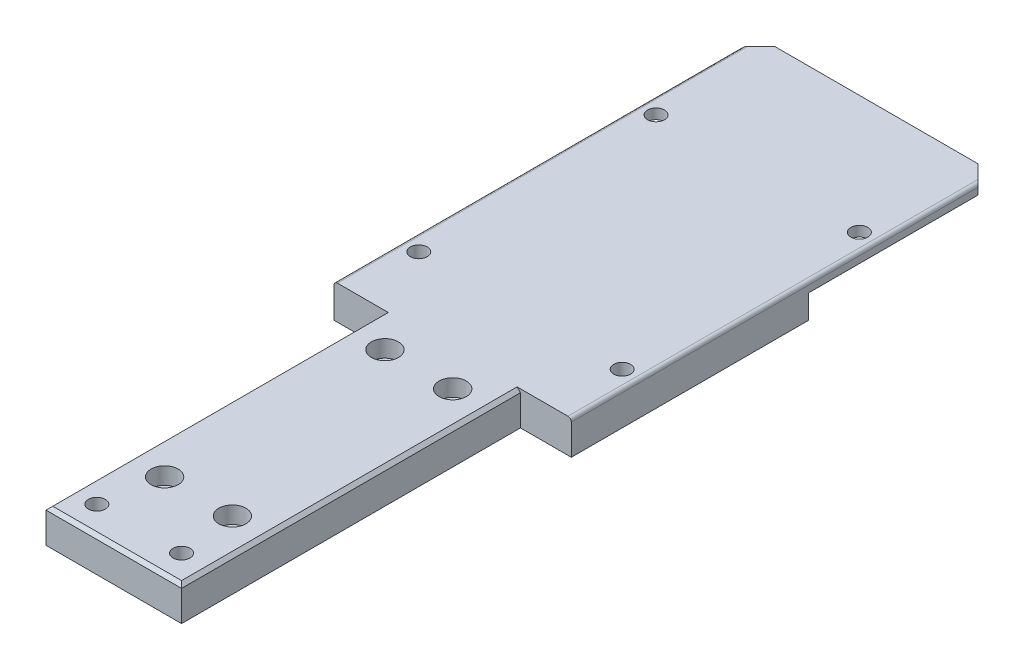
ISO-10303-21;
HEADER;
FILE_DESCRIPTION(('STEP AP214'),'2;1');
FILE_NAME('part.step','',(''),(''),'','','');
FILE_SCHEMA(('AUTOMOTIVE_DESIGN { 1 0 10303 214 1 1 1 1 }'));
ENDSEC;
DATA;
#1=APPLICATION_CONTEXT('core data for automotive mechanical design processes');
#2=APPLICATION_PROTOCOL_DEFINITION('international standard','automotive_design',2000,#1);
#3=PRODUCT_CONTEXT('',#1,'mechanical');
#4=PRODUCT('Part','Part','',(#3));
#5=PRODUCT_RELATED_PRODUCT_CATEGORY('part','',(#4));
#6=PRODUCT_DEFINITION_FORMATION('','',#4);
#7=PRODUCT_DEFINITION_CONTEXT('part definition',#1,'design');
#8=PRODUCT_DEFINITION('design','',#6,#7);
#9=PRODUCT_DEFINITION_SHAPE('','',#8);
#10=(LENGTH_UNIT() NAMED_UNIT(*) SI_UNIT(.MILLI.,.METRE.));
#11=(NAMED_UNIT(*) PLANE_ANGLE_UNIT() SI_UNIT($,.RADIAN.));
#12=(NAMED_UNIT(*) SI_UNIT($,.STERADIAN.) SOLID_ANGLE_UNIT());
#13=UNCERTAINTY_MEASURE_WITH_UNIT(LENGTH_MEASURE(1.E-05),#10,'distance_accuracy_value','');
#14=(GEOMETRIC_REPRESENTATION_CONTEXT(3) GLOBAL_UNCERTAINTY_ASSIGNED_CONTEXT((#13)) GLOBAL_UNIT_ASSIGNED_CONTEXT((#10,
#11,#12)) REPRESENTATION_CONTEXT('',''));
#15=CARTESIAN_POINT('',(0.,0.,0.));
#16=DIRECTION('',(0.,0.,1.));
#17=DIRECTION('',(1.,0.,0.));
#18=AXIS2_PLACEMENT_3D('',#15,#16,#17);
#19=CARTESIAN_POINT('',(55.,10.,-220.));
#20=DIRECTION('',(-0.707106781186549,0.,0.707106781186546));
#21=DIRECTION('',(0.707106781186546,0.,0.707106781186549));
#22=AXIS2_PLACEMENT_3D('',#19,#20,#21);
#23=PLANE('',#22);
#24=DIRECTION('',(-0.707106781186546,0.,-0.707106781186549));
#25=VECTOR('',#24,1.);
#26=CARTESIAN_POINT('',(55.,10.,-220.));
#27=LINE('',#26,#25);
#28=CARTESIAN_POINT('',(54.,10.,-221.));
#29=VERTEX_POINT('',#28);
#30=CARTESIAN_POINT('',(50.,10.,-225.));
#31=VERTEX_POINT('',#30);
#32=EDGE_CURVE('E193',#29,#31,#27,.T.);
#33=ORIENTED_EDGE('',*,*,#32,.F.);
#34=CARTESIAN_POINT('',(54.,9.,-221.));
#35=DIRECTION('',(-0.707106781186549,0.,0.707106781186546));
#36=DIRECTION('',(0.707106781186546,0.,0.707106781186549));
#37=AXIS2_PLACEMENT_3D('',#34,#35,#36);
#38=ELLIPSE('',#37,1.4142135623731,1.);
#39=CARTESIAN_POINT('',(55.,9.,-220.));
#40=VERTEX_POINT('',#39);
#41=EDGE_CURVE('E278',#29,#40,#38,.F.);
#42=ORIENTED_EDGE('',*,*,#41,.T.);
#43=DIRECTION('',(0.,-1.,0.));
#44=VECTOR('',#43,1.);
#45=CARTESIAN_POINT('',(55.,10.,-220.));
#46=LINE('',#45,#44);
#47=CARTESIAN_POINT('',(55.,7.,-220.));
#48=VERTEX_POINT('',#47);
#49=EDGE_CURVE('E229',#40,#48,#46,.T.);
#50=ORIENTED_EDGE('',*,*,#49,.T.);
#51=DIRECTION('',(0.707106781186546,0.,0.707106781186549));
#52=VECTOR('',#51,1.);
#53=CARTESIAN_POINT('',(50.,7.,-225.));
#54=LINE('',#53,#52);
#55=CARTESIAN_POINT('',(50.,7.,-225.));
#56=VERTEX_POINT('',#55);
#57=EDGE_CURVE('E174',#56,#48,#54,.T.);
#58=ORIENTED_EDGE('',*,*,#57,.F.);
#59=DIRECTION('',(0.,-1.,0.));
#60=VECTOR('',#59,1.);
#61=CARTESIAN_POINT('',(50.,10.,-225.));
#62=LINE('',#61,#60);
#63=EDGE_CURVE('E226',#31,#56,#62,.T.);
#64=ORIENTED_EDGE('',*,*,#63,.F.);
#65=EDGE_LOOP('',(#33,#42,#50,#58,#64));
#66=FACE_BOUND('',#65,.T.);
#67=ADVANCED_FACE('F39',(#66),#23,.F.);
#68=CARTESIAN_POINT('',(50.,10.,-225.));
#69=DIRECTION('',(0.,0.,1.));
#70=DIRECTION('',(1.,0.,0.));
#71=AXIS2_PLACEMENT_3D('',#68,#69,#70);
#72=PLANE('',#71);
#73=DIRECTION('',(1.,0.,0.));
#74=VECTOR('',#73,1.);
#75=CARTESIAN_POINT('',(-9.99999999999998,7.,-225.));
#76=LINE('',#75,#74);
#77=CARTESIAN_POINT('',(-9.99999999999998,7.,-225.));
#78=VERTEX_POINT('',#77);
#79=EDGE_CURVE('E172',#78,#56,#76,.T.);
#80=ORIENTED_EDGE('',*,*,#79,.F.);
#81=DIRECTION('',(0.,-1.,0.));
#82=VECTOR('',#81,1.);
#83=CARTESIAN_POINT('',(-9.99999999999998,10.,-225.));
#84=LINE('',#83,#82);
#85=CARTESIAN_POINT('',(-9.99999999999998,10.,-225.));
#86=VERTEX_POINT('',#85);
#87=EDGE_CURVE('E156',#86,#78,#84,.T.);
#88=ORIENTED_EDGE('',*,*,#87,.F.);
#89=DIRECTION('',(-1.,0.,0.));
#90=VECTOR('',#89,1.);
#91=CARTESIAN_POINT('',(50.,10.,-225.));
#92=LINE('',#91,#90);
#93=EDGE_CURVE('E196',#31,#86,#92,.T.);
#94=ORIENTED_EDGE('',*,*,#93,.F.);
#95=ORIENTED_EDGE('',*,*,#63,.T.);
#96=EDGE_LOOP('',(#80,#88,#94,#95));
#97=FACE_BOUND('',#96,.T.);
#98=ADVANCED_FACE('F323',(#97),#72,.F.);
#99=CARTESIAN_POINT('',(-9.99999999999998,10.,-225.));
#100=DIRECTION('',(0.707106781186546,0.,0.707106781186549));
#101=DIRECTION('',(0.707106781186549,0.,-0.707106781186546));
#102=AXIS2_PLACEMENT_3D('',#99,#100,#101);
#103=PLANE('',#102);
#104=DIRECTION('',(0.,-1.,0.));
#105=VECTOR('',#104,1.);
#106=CARTESIAN_POINT('',(-15.,10.,-220.));
#107=LINE('',#106,#105);
#108=CARTESIAN_POINT('',(-15.,9.,-220.));
#109=VERTEX_POINT('',#108);
#110=CARTESIAN_POINT('',(-15.,7.,-220.));
#111=VERTEX_POINT('',#110);
#112=EDGE_CURVE('E148',#109,#111,#107,.T.);
#113=ORIENTED_EDGE('',*,*,#112,.F.);
#114=CARTESIAN_POINT('',(-14.,9.,-221.));
#115=DIRECTION('',(0.707106781186546,0.,0.707106781186549));
#116=DIRECTION('',(0.707106781186549,0.,-0.707106781186546));
#117=AXIS2_PLACEMENT_3D('',#114,#115,#116);
#118=ELLIPSE('',#117,1.41421356237309,1.);
#119=CARTESIAN_POINT('',(-14.,10.,-221.));
#120=VERTEX_POINT('',#119);
#121=EDGE_CURVE('E11',#109,#120,#118,.F.);
#122=ORIENTED_EDGE('',*,*,#121,.T.);
#123=DIRECTION('',(-0.707106781186549,0.,0.707106781186545));
#124=VECTOR('',#123,1.);
#125=CARTESIAN_POINT('',(-9.99999999999998,10.,-225.));
#126=LINE('',#125,#124);
#127=EDGE_CURVE('E198',#86,#120,#126,.T.);
#128=ORIENTED_EDGE('',*,*,#127,.F.);
#129=ORIENTED_EDGE('',*,*,#87,.T.);
#130=DIRECTION('',(0.707106781186549,0.,-0.707106781186545));
#131=VECTOR('',#130,1.);
#132=CARTESIAN_POINT('',(-15.,7.,-220.));
#133=LINE('',#132,#131);
#134=EDGE_CURVE('E162',#111,#78,#133,.T.);
#135=ORIENTED_EDGE('',*,*,#134,.F.);
#136=EDGE_LOOP('',(#113,#122,#128,#129,#135));
#137=FACE_BOUND('',#136,.T.);
#138=ADVANCED_FACE('F169',(#137),#103,.F.);
#139=CARTESIAN_POINT('',(0.,10.,-100.));
#140=DIRECTION('',(1.,0.,0.));
#141=DIRECTION('',(0.,0.,-1.));
#142=AXIS2_PLACEMENT_3D('',#139,#140,#141);
#143=PLANE('',#142);
#144=DIRECTION('',(0.,-1.,0.));
#145=VECTOR('',#144,1.);
#146=CARTESIAN_POINT('',(0.,10.,0.));
#147=LINE('',#146,#145);
#148=CARTESIAN_POINT('',(0.,9.,0.));
#149=VERTEX_POINT('',#148);
#150=CARTESIAN_POINT('',(0.,0.,0.));
#151=VERTEX_POINT('',#150);
#152=EDGE_CURVE('E237',#149,#151,#147,.T.);
#153=ORIENTED_EDGE('',*,*,#152,.F.);
#154=DIRECTION('',(0.,0.,-1.));
#155=VECTOR('',#154,1.);
#156=CARTESIAN_POINT('',(0.,9.,-100.));
#157=LINE('',#156,#155);
#158=CARTESIAN_POINT('',(0.,9.,-100.));
#159=VERTEX_POINT('',#158);
#160=EDGE_CURVE('E255',#149,#159,#157,.T.);
#161=ORIENTED_EDGE('',*,*,#160,.T.);
#162=DIRECTION('',(0.,-1.,0.));
#163=VECTOR('',#162,1.);
#164=CARTESIAN_POINT('',(0.,10.,-100.));
#165=LINE('',#164,#163);
#166=CARTESIAN_POINT('',(0.,0.,-100.));
#167=VERTEX_POINT('',#166);
#168=EDGE_CURVE('E203',#159,#167,#165,.T.);
#169=ORIENTED_EDGE('',*,*,#168,.T.);
#170=DIRECTION('',(0.,0.,1.));
#171=VECTOR('',#170,1.);
#172=CARTESIAN_POINT('',(0.,0.,-100.));
#173=LINE('',#172,#171);
#174=EDGE_CURVE('E188',#167,#151,#173,.T.);
#175=ORIENTED_EDGE('',*,*,#174,.T.);
#176=EDGE_LOOP('',(#153,#161,#169,#175));
#177=FACE_BOUND('',#176,.T.);
#178=ADVANCED_FACE('F331',(#177),#143,.F.);
#179=CARTESIAN_POINT('',(0.,10.,0.));
#180=DIRECTION('',(0.,0.,-1.));
#181=DIRECTION('',(-1.,0.,0.));
#182=AXIS2_PLACEMENT_3D('',#179,#180,#181);
#183=PLANE('',#182);
#184=DIRECTION('',(0.,-1.,0.));
#185=VECTOR('',#184,1.);
#186=CARTESIAN_POINT('',(40.,10.,0.));
#187=LINE('',#186,#185);
#188=CARTESIAN_POINT('',(40.,9.,0.));
#189=VERTEX_POINT('',#188);
#190=CARTESIAN_POINT('',(40.,0.,0.));
#191=VERTEX_POINT('',#190);
#192=EDGE_CURVE('E235',#189,#191,#187,.T.);
#193=ORIENTED_EDGE('',*,*,#192,.F.);
#194=DIRECTION('',(-1.,0.,0.));
#195=VECTOR('',#194,1.);
#196=CARTESIAN_POINT('',(0.,9.,0.));
#197=LINE('',#196,#195);
#198=EDGE_CURVE('E259',#189,#149,#197,.T.);
#199=ORIENTED_EDGE('',*,*,#198,.T.);
#200=ORIENTED_EDGE('',*,*,#152,.T.);
#201=DIRECTION('',(1.,0.,0.));
#202=VECTOR('',#201,1.);
#203=CARTESIAN_POINT('',(0.,0.,0.));
#204=LINE('',#203,#202);
#205=EDGE_CURVE('E206',#151,#191,#204,.T.);
#206=ORIENTED_EDGE('',*,*,#205,.T.);
#207=EDGE_LOOP('',(#193,#199,#200,#206));
#208=FACE_BOUND('',#207,.T.);
#209=ADVANCED_FACE('F344',(#208),#183,.F.);
#210=CARTESIAN_POINT('',(40.,10.,0.));
#211=DIRECTION('',(-1.,0.,0.));
#212=DIRECTION('',(0.,0.,1.));
#213=AXIS2_PLACEMENT_3D('',#210,#211,#212);
#214=PLANE('',#213);
#215=DIRECTION('',(0.,-1.,0.));
#216=VECTOR('',#215,1.);
#217=CARTESIAN_POINT('',(40.,10.,-100.));
#218=LINE('',#217,#216);
#219=CARTESIAN_POINT('',(40.,9.,-100.));
#220=VERTEX_POINT('',#219);
#221=CARTESIAN_POINT('',(40.,0.,-100.));
#222=VERTEX_POINT('',#221);
#223=EDGE_CURVE('E233',#220,#222,#218,.T.);
#224=ORIENTED_EDGE('',*,*,#223,.F.);
#225=DIRECTION('',(0.,0.,1.));
#226=VECTOR('',#225,1.);
#227=CARTESIAN_POINT('',(40.,9.,0.));
#228=LINE('',#227,#226);
#229=EDGE_CURVE('E257',#220,#189,#228,.T.);
#230=ORIENTED_EDGE('',*,*,#229,.T.);
#231=ORIENTED_EDGE('',*,*,#192,.T.);
#232=DIRECTION('',(0.,0.,-1.));
#233=VECTOR('',#232,1.);
#234=CARTESIAN_POINT('',(40.,0.,0.));
#235=LINE('',#234,#233);
#236=EDGE_CURVE('E209',#191,#222,#235,.T.);
#237=ORIENTED_EDGE('',*,*,#236,.T.);
#238=EDGE_LOOP('',(#224,#230,#231,#237));
#239=FACE_BOUND('',#238,.T.);
#240=ADVANCED_FACE('F341',(#239),#214,.F.);
#241=CARTESIAN_POINT('',(40.,10.,-100.));
#242=DIRECTION('',(0.,0.,-1.));
#243=DIRECTION('',(-1.,0.,0.));
#244=AXIS2_PLACEMENT_3D('',#241,#242,#243);
#245=PLANE('',#244);
#246=DIRECTION('',(0.,-1.,0.));
#247=VECTOR('',#246,1.);
#248=CARTESIAN_POINT('',(55.,10.,-100.));
#249=LINE('',#248,#247);
#250=CARTESIAN_POINT('',(55.,9.,-100.));
#251=VERTEX_POINT('',#250);
#252=CARTESIAN_POINT('',(55.,0.,-100.));
#253=VERTEX_POINT('',#252);
#254=EDGE_CURVE('E231',#251,#253,#249,.T.);
#255=ORIENTED_EDGE('',*,*,#254,.F.);
#256=CARTESIAN_POINT('',(54.,9.,-100.));
#257=DIRECTION('',(0.,0.,-1.));
#258=DIRECTION('',(-1.,0.,0.));
#259=AXIS2_PLACEMENT_3D('',#256,#257,#258);
#260=CIRCLE('',#259,1.);
#261=CARTESIAN_POINT('',(54.,10.,-100.));
#262=VERTEX_POINT('',#261);
#263=EDGE_CURVE('E282',#251,#262,#260,.F.);
#264=ORIENTED_EDGE('',*,*,#263,.T.);
#265=DIRECTION('',(1.,0.,0.));
#266=VECTOR('',#265,1.);
#267=CARTESIAN_POINT('',(40.,10.,-100.));
#268=LINE('',#267,#266);
#269=CARTESIAN_POINT('',(39.,10.,-100.));
#270=VERTEX_POINT('',#269);
#271=EDGE_CURVE('E190',#270,#262,#268,.T.);
#272=ORIENTED_EDGE('',*,*,#271,.F.);
#273=DIRECTION('',(0.707106781186538,-0.707106781186557,0.));
#274=VECTOR('',#273,1.);
#275=CARTESIAN_POINT('',(39.5,9.50000000000001,-100.));
#276=LINE('',#275,#274);
#277=EDGE_CURVE('E264',#270,#220,#276,.T.);
#278=ORIENTED_EDGE('',*,*,#277,.T.);
#279=ORIENTED_EDGE('',*,*,#223,.T.);
#280=DIRECTION('',(1.,0.,0.));
#281=VECTOR('',#280,1.);
#282=CARTESIAN_POINT('',(40.,0.,-100.));
#283=LINE('',#282,#281);
#284=EDGE_CURVE('E212',#222,#253,#283,.T.);
#285=ORIENTED_EDGE('',*,*,#284,.T.);
#286=EDGE_LOOP('',(#255,#264,#272,#278,#279,#285));
#287=FACE_BOUND('',#286,.T.);
#288=ADVANCED_FACE('F287',(#287),#245,.F.);
#289=CARTESIAN_POINT('',(55.,10.,-100.));
#290=DIRECTION('',(-1.,0.,0.));
#291=DIRECTION('',(0.,0.,1.));
#292=AXIS2_PLACEMENT_3D('',#289,#290,#291);
#293=PLANE('',#292);
#294=ORIENTED_EDGE('',*,*,#49,.F.);
#295=DIRECTION('',(0.,0.,-1.));
#296=VECTOR('',#295,1.);
#297=CARTESIAN_POINT('',(55.,9.,-100.));
#298=LINE('',#297,#296);
#299=EDGE_CURVE('E280',#40,#251,#298,.F.);
#300=ORIENTED_EDGE('',*,*,#299,.T.);
#301=ORIENTED_EDGE('',*,*,#254,.T.);
#302=DIRECTION('',(0.,0.,-1.));
#303=VECTOR('',#302,1.);
#304=CARTESIAN_POINT('',(55.,0.,-100.));
#305=LINE('',#304,#303);
#306=CARTESIAN_POINT('',(55.,0.,-170.));
#307=VERTEX_POINT('',#306);
#308=EDGE_CURVE('E215',#253,#307,#305,.T.);
#309=ORIENTED_EDGE('',*,*,#308,.T.);
#310=DIRECTION('',(0.,-1.,0.));
#311=VECTOR('',#310,1.);
#312=CARTESIAN_POINT('',(55.,7.,-170.));
#313=LINE('',#312,#311);
#314=CARTESIAN_POINT('',(55.,7.,-170.));
#315=VERTEX_POINT('',#314);
#316=EDGE_CURVE('E183',#315,#307,#313,.T.);
#317=ORIENTED_EDGE('',*,*,#316,.F.);
#318=DIRECTION('',(0.,0.,1.));
#319=VECTOR('',#318,1.);
#320=CARTESIAN_POINT('',(55.,7.,-220.));
#321=LINE('',#320,#319);
#322=EDGE_CURVE('E180',#48,#315,#321,.T.);
#323=ORIENTED_EDGE('',*,*,#322,.F.);
#324=EDGE_LOOP('',(#294,#300,#301,#309,#317,#323));
#325=FACE_BOUND('',#324,.T.);
#326=ADVANCED_FACE('F304',(#325),#293,.F.);
#327=CARTESIAN_POINT('',(-15.,10.,-220.));
#328=DIRECTION('',(1.,0.,0.));
#329=DIRECTION('',(0.,0.,-1.));
#330=AXIS2_PLACEMENT_3D('',#327,#328,#329);
#331=PLANE('',#330);
#332=DIRECTION('',(0.,-1.,0.));
#333=VECTOR('',#332,1.);
#334=CARTESIAN_POINT('',(-15.,10.,-100.));
#335=LINE('',#334,#333);
#336=CARTESIAN_POINT('',(-15.,9.,-100.));
#337=VERTEX_POINT('',#336);
#338=CARTESIAN_POINT('',(-15.,0.,-100.));
#339=VERTEX_POINT('',#338);
#340=EDGE_CURVE('E157',#337,#339,#335,.T.);
#341=ORIENTED_EDGE('',*,*,#340,.F.);
#342=DIRECTION('',(0.,0.,1.));
#343=VECTOR('',#342,1.);
#344=CARTESIAN_POINT('',(-15.,9.,-220.));
#345=LINE('',#344,#343);
#346=EDGE_CURVE('E47',#337,#109,#345,.F.);
#347=ORIENTED_EDGE('',*,*,#346,.T.);
#348=ORIENTED_EDGE('',*,*,#112,.T.);
#349=DIRECTION('',(0.,0.,-1.));
#350=VECTOR('',#349,1.);
#351=CARTESIAN_POINT('',(-15.,7.,-170.));
#352=LINE('',#351,#350);
#353=CARTESIAN_POINT('',(-15.,7.,-170.));
#354=VERTEX_POINT('',#353);
#355=EDGE_CURVE('E152',#354,#111,#352,.T.);
#356=ORIENTED_EDGE('',*,*,#355,.F.);
#357=DIRECTION('',(0.,-1.,0.));
#358=VECTOR('',#357,1.);
#359=CARTESIAN_POINT('',(-15.,7.,-170.));
#360=LINE('',#359,#358);
#361=CARTESIAN_POINT('',(-15.,0.,-170.));
#362=VERTEX_POINT('',#361);
#363=EDGE_CURVE('E186',#354,#362,#360,.T.);
#364=ORIENTED_EDGE('',*,*,#363,.T.);
#365=DIRECTION('',(0.,0.,1.));
#366=VECTOR('',#365,1.);
#367=CARTESIAN_POINT('',(-15.,0.,-220.));
#368=LINE('',#367,#366);
#369=EDGE_CURVE('E218',#362,#339,#368,.T.);
#370=ORIENTED_EDGE('',*,*,#369,.T.);
#371=EDGE_LOOP('',(#341,#347,#348,#356,#364,#370));
#372=FACE_BOUND('',#371,.T.);
#373=ADVANCED_FACE('F150',(#372),#331,.F.);
#374=CARTESIAN_POINT('',(-15.,10.,-100.));
#375=DIRECTION('',(0.,0.,-1.));
#376=DIRECTION('',(-1.,0.,0.));
#377=AXIS2_PLACEMENT_3D('',#374,#375,#376);
#378=PLANE('',#377);
#379=DIRECTION('',(1.,0.,0.));
#380=VECTOR('',#379,1.);
#381=CARTESIAN_POINT('',(-15.,10.,-100.));
#382=LINE('',#381,#380);
#383=CARTESIAN_POINT('',(-14.,10.,-100.));
#384=VERTEX_POINT('',#383);
#385=CARTESIAN_POINT('',(0.999999999999967,10.,-100.));
#386=VERTEX_POINT('',#385);
#387=EDGE_CURVE('E201',#384,#386,#382,.T.);
#388=ORIENTED_EDGE('',*,*,#387,.F.);
#389=CARTESIAN_POINT('',(-14.,9.,-100.));
#390=DIRECTION('',(0.,0.,-1.));
#391=DIRECTION('',(-1.,0.,0.));
#392=AXIS2_PLACEMENT_3D('',#389,#390,#391);
#393=CIRCLE('',#392,1.);
#394=EDGE_CURVE('E61',#384,#337,#393,.F.);
#395=ORIENTED_EDGE('',*,*,#394,.T.);
#396=ORIENTED_EDGE('',*,*,#340,.T.);
#397=DIRECTION('',(1.,0.,0.));
#398=VECTOR('',#397,1.);
#399=CARTESIAN_POINT('',(-15.,0.,-100.));
#400=LINE('',#399,#398);
#401=EDGE_CURVE('E194',#339,#167,#400,.T.);
#402=ORIENTED_EDGE('',*,*,#401,.T.);
#403=ORIENTED_EDGE('',*,*,#168,.F.);
#404=DIRECTION('',(0.707106781186538,0.707106781186557,0.));
#405=VECTOR('',#404,1.);
#406=CARTESIAN_POINT('',(-6.9999999999998,2.00000000000001,-100.));
#407=LINE('',#406,#405);
#408=EDGE_CURVE('E261',#159,#386,#407,.T.);
#409=ORIENTED_EDGE('',*,*,#408,.T.);
#410=EDGE_LOOP('',(#388,#395,#396,#402,#403,#409));
#411=FACE_BOUND('',#410,.T.);
#412=ADVANCED_FACE('F317',(#411),#378,.F.);
#413=CARTESIAN_POINT('',(0.,10.,0.));
#414=DIRECTION('',(0.,1.,0.));
#415=DIRECTION('',(0.,0.,1.));
#416=AXIS2_PLACEMENT_3D('',#413,#414,#415);
#417=PLANE('',#416);
#418=ORIENTED_EDGE('',*,*,#271,.T.);
#419=DIRECTION('',(0.,0.,-1.));
#420=VECTOR('',#419,1.);
#421=CARTESIAN_POINT('',(54.,10.,-220.));
#422=LINE('',#421,#420);
#423=EDGE_CURVE('E275',#262,#29,#422,.T.);
#424=ORIENTED_EDGE('',*,*,#423,.T.);
#425=ORIENTED_EDGE('',*,*,#32,.T.);
#426=ORIENTED_EDGE('',*,*,#93,.T.);
#427=ORIENTED_EDGE('',*,*,#127,.T.);
#428=DIRECTION('',(0.,0.,1.));
#429=VECTOR('',#428,1.);
#430=CARTESIAN_POINT('',(-14.,10.,-100.));
#431=LINE('',#430,#429);
#432=EDGE_CURVE('E266',#120,#384,#431,.T.);
#433=ORIENTED_EDGE('',*,*,#432,.T.);
#434=ORIENTED_EDGE('',*,*,#387,.T.);
#435=DIRECTION('',(0.,0.,1.));
#436=VECTOR('',#435,1.);
#437=CARTESIAN_POINT('',(0.999999999999973,10.,0.));
#438=LINE('',#437,#436);
#439=CARTESIAN_POINT('',(0.999999999999973,10.,-0.999999999999973));
#440=VERTEX_POINT('',#439);
#441=EDGE_CURVE('E252',#386,#440,#438,.T.);
#442=ORIENTED_EDGE('',*,*,#441,.T.);
#443=DIRECTION('',(1.,0.,0.));
#444=VECTOR('',#443,1.);
#445=CARTESIAN_POINT('',(40.,10.,-0.999999999999973));
#446=LINE('',#445,#444);
#447=CARTESIAN_POINT('',(39.,10.,-0.999999999999973));
#448=VERTEX_POINT('',#447);
#449=EDGE_CURVE('E239',#440,#448,#446,.T.);
#450=ORIENTED_EDGE('',*,*,#449,.T.);
#451=DIRECTION('',(0.,0.,-1.));
#452=VECTOR('',#451,1.);
#453=CARTESIAN_POINT('',(39.,10.,-100.));
#454=LINE('',#453,#452);
#455=EDGE_CURVE('E249',#448,#270,#454,.T.);
#456=ORIENTED_EDGE('',*,*,#455,.T.);
#457=EDGE_LOOP('',(#418,#424,#425,#426,#427,#433,#434,#442,#450,#456));
#458=FACE_BOUND('',#457,.T.);
#459=CARTESIAN_POINT('',(32.,10.,-8.));
#460=DIRECTION('',(0.,1.,0.));
#461=DIRECTION('',(0.,0.,1.));
#462=AXIS2_PLACEMENT_3D('',#459,#460,#461);
#463=CIRCLE('',#462,2.5);
#464=CARTESIAN_POINT('',(32.,10.,-5.5));
#465=VERTEX_POINT('',#464);
#466=EDGE_CURVE('E824',#465,#465,#463,.T.);
#467=ORIENTED_EDGE('',*,*,#466,.F.);
#468=EDGE_LOOP('',(#467));
#469=FACE_BOUND('',#468,.T.);
#470=CARTESIAN_POINT('',(7.00000214893177,10.,-8.01036564440876));
#471=DIRECTION('',(0.,1.,0.));
#472=DIRECTION('',(0.,0.,1.));
#473=AXIS2_PLACEMENT_3D('',#470,#471,#472);
#474=CIRCLE('',#473,2.5);
#475=CARTESIAN_POINT('',(7.00000214893177,10.,-5.51036564440876));
#476=VERTEX_POINT('',#475);
#477=EDGE_CURVE('E821',#476,#476,#474,.T.);
#478=ORIENTED_EDGE('',*,*,#477,.F.);
#479=EDGE_LOOP('',(#478));
#480=FACE_BOUND('',#479,.T.);
#481=CARTESIAN_POINT('',(50.,10.,-120.));
#482=DIRECTION('',(0.,1.,0.));
#483=DIRECTION('',(0.,0.,1.));
#484=AXIS2_PLACEMENT_3D('',#481,#482,#483);
#485=CIRCLE('',#484,2.5);
#486=CARTESIAN_POINT('',(50.,10.,-117.5));
#487=VERTEX_POINT('',#486);
#488=EDGE_CURVE('E807',#487,#487,#485,.T.);
#489=ORIENTED_EDGE('',*,*,#488,.F.);
#490=EDGE_LOOP('',(#489));
#491=FACE_BOUND('',#490,.T.);
#492=CARTESIAN_POINT('',(-10.,10.,-120.));
#493=DIRECTION('',(0.,1.,0.));
#494=DIRECTION('',(0.,0.,1.));
#495=AXIS2_PLACEMENT_3D('',#492,#493,#494);
#496=CIRCLE('',#495,2.5);
#497=CARTESIAN_POINT('',(-10.,10.,-117.5));
#498=VERTEX_POINT('',#497);
#499=EDGE_CURVE('E814',#498,#498,#496,.T.);
#500=ORIENTED_EDGE('',*,*,#499,.F.);
#501=EDGE_LOOP('',(#500));
#502=FACE_BOUND('',#501,.T.);
#503=CARTESIAN_POINT('',(-10.,10.,-190.));
#504=DIRECTION('',(0.,1.,0.));
#505=DIRECTION('',(0.,0.,1.));
#506=AXIS2_PLACEMENT_3D('',#503,#504,#505);
#507=CIRCLE('',#506,2.5);
#508=CARTESIAN_POINT('',(-10.,10.,-187.5));
#509=VERTEX_POINT('',#508);
#510=EDGE_CURVE('E803',#509,#509,#507,.T.);
#511=ORIENTED_EDGE('',*,*,#510,.F.);
#512=EDGE_LOOP('',(#511));
#513=FACE_BOUND('',#512,.T.);
#514=CARTESIAN_POINT('',(50.,10.,-190.));
#515=DIRECTION('',(0.,1.,0.));
#516=DIRECTION('',(0.,0.,1.));
#517=AXIS2_PLACEMENT_3D('',#514,#515,#516);
#518=CIRCLE('',#517,2.5);
#519=CARTESIAN_POINT('',(50.,10.,-187.5));
#520=VERTEX_POINT('',#519);
#521=EDGE_CURVE('E244',#520,#520,#518,.T.);
#522=ORIENTED_EDGE('',*,*,#521,.F.);
#523=EDGE_LOOP('',(#522));
#524=FACE_BOUND('',#523,.T.);
#525=CARTESIAN_POINT('',(30.,10.,-25.));
#526=DIRECTION('',(0.,1.,0.));
#527=DIRECTION('',(0.,0.,1.));
#528=AXIS2_PLACEMENT_3D('',#525,#526,#527);
#529=CIRCLE('',#528,4.00000000000001);
#530=CARTESIAN_POINT('',(30.,10.,-21.));
#531=VERTEX_POINT('',#530);
#532=EDGE_CURVE('E758',#531,#531,#529,.T.);
#533=ORIENTED_EDGE('',*,*,#532,.F.);
#534=EDGE_LOOP('',(#533));
#535=FACE_BOUND('',#534,.T.);
#536=CARTESIAN_POINT('',(9.99999999999999,10.,-90.));
#537=DIRECTION('',(0.,1.,0.));
#538=DIRECTION('',(0.,0.,1.));
#539=AXIS2_PLACEMENT_3D('',#536,#537,#538);
#540=CIRCLE('',#539,4.00000000000001);
#541=CARTESIAN_POINT('',(9.99999999999999,10.,-86.));
#542=VERTEX_POINT('',#541);
#543=EDGE_CURVE('E767',#542,#542,#540,.T.);
#544=ORIENTED_EDGE('',*,*,#543,.F.);
#545=EDGE_LOOP('',(#544));
#546=FACE_BOUND('',#545,.T.);
#547=CARTESIAN_POINT('',(30.,10.,-90.));
#548=DIRECTION('',(0.,1.,0.));
#549=DIRECTION('',(0.,0.,1.));
#550=AXIS2_PLACEMENT_3D('',#547,#548,#549);
#551=CIRCLE('',#550,4.00000000000002);
#552=CARTESIAN_POINT('',(30.,10.,-86.));
#553=VERTEX_POINT('',#552);
#554=EDGE_CURVE('E768',#553,#553,#551,.T.);
#555=ORIENTED_EDGE('',*,*,#554,.F.);
#556=EDGE_LOOP('',(#555));
#557=FACE_BOUND('',#556,.T.);
#558=CARTESIAN_POINT('',(9.99999999999999,10.,-25.));
#559=DIRECTION('',(0.,1.,0.));
#560=DIRECTION('',(0.,0.,1.));
#561=AXIS2_PLACEMENT_3D('',#558,#559,#560);
#562=CIRCLE('',#561,4.);
#563=CARTESIAN_POINT('',(9.99999999999999,10.,-21.));
#564=VERTEX_POINT('',#563);
#565=EDGE_CURVE('E756',#564,#564,#562,.T.);
#566=ORIENTED_EDGE('',*,*,#565,.F.);
#567=EDGE_LOOP('',(#566));
#568=FACE_BOUND('',#567,.T.);
#569=ADVANCED_FACE('F292',(#458,#469,#480,#491,#502,#513,#524,#535,#546,#557,#568),#417,.T.);
#570=CARTESIAN_POINT('',(0.,0.,0.));
#571=DIRECTION('',(0.,1.,0.));
#572=DIRECTION('',(0.,0.,1.));
#573=AXIS2_PLACEMENT_3D('',#570,#571,#572);
#574=PLANE('',#573);
#575=CARTESIAN_POINT('',(32.,0.,-8.));
#576=DIRECTION('',(0.,1.,0.));
#577=DIRECTION('',(0.,0.,1.));
#578=AXIS2_PLACEMENT_3D('',#575,#576,#577);
#579=CIRCLE('',#578,2.5);
#580=CARTESIAN_POINT('',(32.,0.,-5.5));
#581=VERTEX_POINT('',#580);
#582=EDGE_CURVE('E808',#581,#581,#579,.T.);
#583=ORIENTED_EDGE('',*,*,#582,.T.);
#584=EDGE_LOOP('',(#583));
#585=FACE_BOUND('',#584,.T.);
#586=CARTESIAN_POINT('',(7.00000214893177,0.,-8.01036564440876));
#587=DIRECTION('',(0.,1.,0.));
#588=DIRECTION('',(0.,0.,1.));
#589=AXIS2_PLACEMENT_3D('',#586,#587,#588);
#590=CIRCLE('',#589,2.5);
#591=CARTESIAN_POINT('',(7.00000214893177,0.,-5.51036564440876));
#592=VERTEX_POINT('',#591);
#593=EDGE_CURVE('E272',#592,#592,#590,.T.);
#594=ORIENTED_EDGE('',*,*,#593,.T.);
#595=EDGE_LOOP('',(#594));
#596=FACE_BOUND('',#595,.T.);
#597=CARTESIAN_POINT('',(50.,0.,-120.));
#598=DIRECTION('',(0.,1.,0.));
#599=DIRECTION('',(0.,0.,1.));
#600=AXIS2_PLACEMENT_3D('',#597,#598,#599);
#601=CIRCLE('',#600,2.5);
#602=CARTESIAN_POINT('',(50.,0.,-117.5));
#603=VERTEX_POINT('',#602);
#604=EDGE_CURVE('E804',#603,#603,#601,.T.);
#605=ORIENTED_EDGE('',*,*,#604,.T.);
#606=EDGE_LOOP('',(#605));
#607=FACE_BOUND('',#606,.T.);
#608=CARTESIAN_POINT('',(-10.,0.,-120.));
#609=DIRECTION('',(0.,1.,0.));
#610=DIRECTION('',(0.,0.,1.));
#611=AXIS2_PLACEMENT_3D('',#608,#609,#610);
#612=CIRCLE('',#611,2.5);
#613=CARTESIAN_POINT('',(-10.,0.,-117.5));
#614=VERTEX_POINT('',#613);
#615=EDGE_CURVE('E811',#614,#614,#612,.T.);
#616=ORIENTED_EDGE('',*,*,#615,.T.);
#617=EDGE_LOOP('',(#616));
#618=FACE_BOUND('',#617,.T.);
#619=CARTESIAN_POINT('',(30.,0.,-25.));
#620=DIRECTION('',(0.,1.,0.));
#621=DIRECTION('',(0.,0.,1.));
#622=AXIS2_PLACEMENT_3D('',#619,#620,#621);
#623=CIRCLE('',#622,2.5);
#624=CARTESIAN_POINT('',(30.,0.,-22.5));
#625=VERTEX_POINT('',#624);
#626=EDGE_CURVE('E247',#625,#625,#623,.T.);
#627=ORIENTED_EDGE('',*,*,#626,.T.);
#628=EDGE_LOOP('',(#627));
#629=FACE_BOUND('',#628,.T.);
#630=CARTESIAN_POINT('',(9.99999999999999,0.,-25.));
#631=DIRECTION('',(0.,1.,0.));
#632=DIRECTION('',(0.,0.,1.));
#633=AXIS2_PLACEMENT_3D('',#630,#631,#632);
#634=CIRCLE('',#633,2.5);
#635=CARTESIAN_POINT('',(9.99999999999999,0.,-22.5));
#636=VERTEX_POINT('',#635);
#637=EDGE_CURVE('E790',#636,#636,#634,.T.);
#638=ORIENTED_EDGE('',*,*,#637,.T.);
#639=EDGE_LOOP('',(#638));
#640=FACE_BOUND('',#639,.T.);
#641=CARTESIAN_POINT('',(9.99999999999999,0.,-90.));
#642=DIRECTION('',(0.,1.,0.));
#643=DIRECTION('',(0.,0.,1.));
#644=AXIS2_PLACEMENT_3D('',#641,#642,#643);
#645=CIRCLE('',#644,2.5);
#646=CARTESIAN_POINT('',(9.99999999999999,0.,-87.5));
#647=VERTEX_POINT('',#646);
#648=EDGE_CURVE('E796',#647,#647,#645,.T.);
#649=ORIENTED_EDGE('',*,*,#648,.T.);
#650=EDGE_LOOP('',(#649));
#651=FACE_BOUND('',#650,.T.);
#652=CARTESIAN_POINT('',(30.,0.,-90.));
#653=DIRECTION('',(0.,1.,0.));
#654=DIRECTION('',(0.,0.,1.));
#655=AXIS2_PLACEMENT_3D('',#652,#653,#654);
#656=CIRCLE('',#655,2.5);
#657=CARTESIAN_POINT('',(30.,0.,-87.5));
#658=VERTEX_POINT('',#657);
#659=EDGE_CURVE('E776',#658,#658,#656,.T.);
#660=ORIENTED_EDGE('',*,*,#659,.T.);
#661=EDGE_LOOP('',(#660));
#662=FACE_BOUND('',#661,.T.);
#663=ORIENTED_EDGE('',*,*,#369,.F.);
#664=DIRECTION('',(-1.,0.,0.));
#665=VECTOR('',#664,1.);
#666=CARTESIAN_POINT('',(55.,0.,-170.));
#667=LINE('',#666,#665);
#668=EDGE_CURVE('E166',#307,#362,#667,.T.);
#669=ORIENTED_EDGE('',*,*,#668,.F.);
#670=ORIENTED_EDGE('',*,*,#308,.F.);
#671=ORIENTED_EDGE('',*,*,#284,.F.);
#672=ORIENTED_EDGE('',*,*,#236,.F.);
#673=ORIENTED_EDGE('',*,*,#205,.F.);
#674=ORIENTED_EDGE('',*,*,#174,.F.);
#675=ORIENTED_EDGE('',*,*,#401,.F.);
#676=EDGE_LOOP('',(#663,#669,#670,#671,#672,#673,#674,#675));
#677=FACE_BOUND('',#676,.T.);
#678=ADVANCED_FACE('F312',(#585,#596,#607,#618,#629,#640,#651,#662,#677),#574,.F.);
#679=CARTESIAN_POINT('',(55.,7.,-170.));
#680=DIRECTION('',(0.,0.,1.));
#681=DIRECTION('',(1.,0.,0.));
#682=AXIS2_PLACEMENT_3D('',#679,#680,#681);
#683=PLANE('',#682);
#684=ORIENTED_EDGE('',*,*,#668,.T.);
#685=ORIENTED_EDGE('',*,*,#363,.F.);
#686=DIRECTION('',(-1.,0.,0.));
#687=VECTOR('',#686,1.);
#688=CARTESIAN_POINT('',(55.,7.,-170.));
#689=LINE('',#688,#687);
#690=EDGE_CURVE('E165',#315,#354,#689,.T.);
#691=ORIENTED_EDGE('',*,*,#690,.F.);
#692=ORIENTED_EDGE('',*,*,#316,.T.);
#693=EDGE_LOOP('',(#684,#685,#691,#692));
#694=FACE_BOUND('',#693,.T.);
#695=ADVANCED_FACE('F307',(#694),#683,.F.);
#696=CARTESIAN_POINT('',(0.,7.,0.));
#697=DIRECTION('',(0.,-1.,0.));
#698=DIRECTION('',(0.,0.,-1.));
#699=AXIS2_PLACEMENT_3D('',#696,#697,#698);
#700=PLANE('',#699);
#701=CARTESIAN_POINT('',(-10.,7.,-190.));
#702=DIRECTION('',(0.,-1.,0.));
#703=DIRECTION('',(0.,0.,-1.));
#704=AXIS2_PLACEMENT_3D('',#701,#702,#703);
#705=CIRCLE('',#704,2.5);
#706=CARTESIAN_POINT('',(-10.,7.,-192.5));
#707=VERTEX_POINT('',#706);
#708=EDGE_CURVE('E243',#707,#707,#705,.T.);
#709=ORIENTED_EDGE('',*,*,#708,.F.);
#710=EDGE_LOOP('',(#709));
#711=FACE_BOUND('',#710,.T.);
#712=CARTESIAN_POINT('',(50.,7.,-190.));
#713=DIRECTION('',(0.,-1.,0.));
#714=DIRECTION('',(0.,0.,-1.));
#715=AXIS2_PLACEMENT_3D('',#712,#713,#714);
#716=CIRCLE('',#715,2.5);
#717=CARTESIAN_POINT('',(50.,7.,-192.5));
#718=VERTEX_POINT('',#717);
#719=EDGE_CURVE('E240',#718,#718,#716,.T.);
#720=ORIENTED_EDGE('',*,*,#719,.F.);
#721=EDGE_LOOP('',(#720));
#722=FACE_BOUND('',#721,.T.);
#723=ORIENTED_EDGE('',*,*,#355,.T.);
#724=ORIENTED_EDGE('',*,*,#134,.T.);
#725=ORIENTED_EDGE('',*,*,#79,.T.);
#726=ORIENTED_EDGE('',*,*,#57,.T.);
#727=ORIENTED_EDGE('',*,*,#322,.T.);
#728=ORIENTED_EDGE('',*,*,#690,.T.);
#729=EDGE_LOOP('',(#723,#724,#725,#726,#727,#728));
#730=FACE_BOUND('',#729,.T.);
#731=ADVANCED_FACE('F161',(#711,#722,#730),#700,.T.);
#732=CARTESIAN_POINT('',(9.99999999999999,5.,-25.));
#733=DIRECTION('',(0.,1.,0.));
#734=DIRECTION('',(0.,0.,1.));
#735=AXIS2_PLACEMENT_3D('',#732,#733,#734);
#736=CYLINDRICAL_SURFACE('',#735,4.);
#737=CARTESIAN_POINT('',(9.99999999999999,5.,-25.));
#738=DIRECTION('',(0.,1.,0.));
#739=DIRECTION('',(0.,0.,1.));
#740=AXIS2_PLACEMENT_3D('',#737,#738,#739);
#741=CIRCLE('',#740,4.);
#742=CARTESIAN_POINT('',(9.99999999999999,5.,-21.));
#743=VERTEX_POINT('',#742);
#744=EDGE_CURVE('E185',#743,#743,#741,.T.);
#745=ORIENTED_EDGE('',*,*,#744,.F.);
#746=EDGE_LOOP('',(#745));
#747=FACE_BOUND('',#746,.T.);
#748=ORIENTED_EDGE('',*,*,#565,.T.);
#749=EDGE_LOOP('',(#748));
#750=FACE_BOUND('',#749,.T.);
#751=ADVANCED_FACE('F533',(#747,#750),#736,.F.);
#752=CARTESIAN_POINT('',(9.99999999999999,5.,-25.));
#753=DIRECTION('',(0.,1.,0.));
#754=DIRECTION('',(0.,0.,1.));
#755=AXIS2_PLACEMENT_3D('',#752,#753,#754);
#756=PLANE('',#755);
#757=CARTESIAN_POINT('',(9.99999999999999,5.,-25.));
#758=DIRECTION('',(0.,1.,0.));
#759=DIRECTION('',(0.,0.,1.));
#760=AXIS2_PLACEMENT_3D('',#757,#758,#759);
#761=CIRCLE('',#760,2.5);
#762=CARTESIAN_POINT('',(9.99999999999999,5.,-22.5));
#763=VERTEX_POINT('',#762);
#764=EDGE_CURVE('E793',#763,#763,#761,.T.);
#765=ORIENTED_EDGE('',*,*,#764,.F.);
#766=EDGE_LOOP('',(#765));
#767=FACE_BOUND('',#766,.T.);
#768=ORIENTED_EDGE('',*,*,#744,.T.);
#769=EDGE_LOOP('',(#768));
#770=FACE_BOUND('',#769,.T.);
#771=ADVANCED_FACE('F622',(#767,#770),#756,.T.);
#772=CARTESIAN_POINT('',(30.,5.,-90.));
#773=DIRECTION('',(0.,1.,0.));
#774=DIRECTION('',(0.,0.,1.));
#775=AXIS2_PLACEMENT_3D('',#772,#773,#774);
#776=CYLINDRICAL_SURFACE('',#775,4.00000000000002);
#777=CARTESIAN_POINT('',(30.,5.,-90.));
#778=DIRECTION('',(0.,1.,0.));
#779=DIRECTION('',(0.,0.,1.));
#780=AXIS2_PLACEMENT_3D('',#777,#778,#779);
#781=CIRCLE('',#780,4.00000000000002);
#782=CARTESIAN_POINT('',(30.,5.,-86.));
#783=VERTEX_POINT('',#782);
#784=EDGE_CURVE('E773',#783,#783,#781,.T.);
#785=ORIENTED_EDGE('',*,*,#784,.F.);
#786=EDGE_LOOP('',(#785));
#787=FACE_BOUND('',#786,.T.);
#788=ORIENTED_EDGE('',*,*,#554,.T.);
#789=EDGE_LOOP('',(#788));
#790=FACE_BOUND('',#789,.T.);
#791=ADVANCED_FACE('F613',(#787,#790),#776,.F.);
#792=CARTESIAN_POINT('',(30.,5.,-90.));
#793=DIRECTION('',(0.,1.,0.));
#794=DIRECTION('',(0.,0.,1.));
#795=AXIS2_PLACEMENT_3D('',#792,#793,#794);
#796=PLANE('',#795);
#797=CARTESIAN_POINT('',(30.,5.,-90.));
#798=DIRECTION('',(0.,1.,0.));
#799=DIRECTION('',(0.,0.,1.));
#800=AXIS2_PLACEMENT_3D('',#797,#798,#799);
#801=CIRCLE('',#800,2.5);
#802=CARTESIAN_POINT('',(30.,5.,-87.5));
#803=VERTEX_POINT('',#802);
#804=EDGE_CURVE('E779',#803,#803,#801,.T.);
#805=ORIENTED_EDGE('',*,*,#804,.F.);
#806=EDGE_LOOP('',(#805));
#807=FACE_BOUND('',#806,.T.);
#808=ORIENTED_EDGE('',*,*,#784,.T.);
#809=EDGE_LOOP('',(#808));
#810=FACE_BOUND('',#809,.T.);
#811=ADVANCED_FACE('F608',(#807,#810),#796,.T.);
#812=CARTESIAN_POINT('',(9.99999999999999,5.,-90.));
#813=DIRECTION('',(0.,1.,0.));
#814=DIRECTION('',(0.,0.,1.));
#815=AXIS2_PLACEMENT_3D('',#812,#813,#814);
#816=CYLINDRICAL_SURFACE('',#815,4.00000000000001);
#817=CARTESIAN_POINT('',(9.99999999999999,5.,-90.));
#818=DIRECTION('',(0.,1.,0.));
#819=DIRECTION('',(0.,0.,1.));
#820=AXIS2_PLACEMENT_3D('',#817,#818,#819);
#821=CIRCLE('',#820,4.00000000000001);
#822=CARTESIAN_POINT('',(9.99999999999999,5.,-86.));
#823=VERTEX_POINT('',#822);
#824=EDGE_CURVE('E764',#823,#823,#821,.T.);
#825=ORIENTED_EDGE('',*,*,#824,.F.);
#826=EDGE_LOOP('',(#825));
#827=FACE_BOUND('',#826,.T.);
#828=ORIENTED_EDGE('',*,*,#543,.T.);
#829=EDGE_LOOP('',(#828));
#830=FACE_BOUND('',#829,.T.);
#831=ADVANCED_FACE('F599',(#827,#830),#816,.F.);
#832=CARTESIAN_POINT('',(9.99999999999999,5.,-90.));
#833=DIRECTION('',(0.,1.,0.));
#834=DIRECTION('',(0.,0.,1.));
#835=AXIS2_PLACEMENT_3D('',#832,#833,#834);
#836=PLANE('',#835);
#837=CARTESIAN_POINT('',(9.99999999999999,5.,-90.));
#838=DIRECTION('',(0.,1.,0.));
#839=DIRECTION('',(0.,0.,1.));
#840=AXIS2_PLACEMENT_3D('',#837,#838,#839);
#841=CIRCLE('',#840,2.5);
#842=CARTESIAN_POINT('',(9.99999999999999,5.,-87.5));
#843=VERTEX_POINT('',#842);
#844=EDGE_CURVE('E782',#843,#843,#841,.T.);
#845=ORIENTED_EDGE('',*,*,#844,.F.);
#846=EDGE_LOOP('',(#845));
#847=FACE_BOUND('',#846,.T.);
#848=ORIENTED_EDGE('',*,*,#824,.T.);
#849=EDGE_LOOP('',(#848));
#850=FACE_BOUND('',#849,.T.);
#851=ADVANCED_FACE('F594',(#847,#850),#836,.T.);
#852=CARTESIAN_POINT('',(30.,5.,-25.));
#853=DIRECTION('',(0.,1.,0.));
#854=DIRECTION('',(0.,0.,1.));
#855=AXIS2_PLACEMENT_3D('',#852,#853,#854);
#856=CYLINDRICAL_SURFACE('',#855,4.00000000000001);
#857=CARTESIAN_POINT('',(30.,5.,-25.));
#858=DIRECTION('',(0.,1.,0.));
#859=DIRECTION('',(0.,0.,1.));
#860=AXIS2_PLACEMENT_3D('',#857,#858,#859);
#861=CIRCLE('',#860,4.00000000000001);
#862=CARTESIAN_POINT('',(30.,5.,-21.));
#863=VERTEX_POINT('',#862);
#864=EDGE_CURVE('E761',#863,#863,#861,.T.);
#865=ORIENTED_EDGE('',*,*,#864,.F.);
#866=EDGE_LOOP('',(#865));
#867=FACE_BOUND('',#866,.T.);
#868=ORIENTED_EDGE('',*,*,#532,.T.);
#869=EDGE_LOOP('',(#868));
#870=FACE_BOUND('',#869,.T.);
#871=ADVANCED_FACE('F585',(#867,#870),#856,.F.);
#872=CARTESIAN_POINT('',(30.,5.,-25.));
#873=DIRECTION('',(0.,1.,0.));
#874=DIRECTION('',(0.,0.,1.));
#875=AXIS2_PLACEMENT_3D('',#872,#873,#874);
#876=PLANE('',#875);
#877=CARTESIAN_POINT('',(30.,5.,-25.));
#878=DIRECTION('',(0.,1.,0.));
#879=DIRECTION('',(0.,0.,1.));
#880=AXIS2_PLACEMENT_3D('',#877,#878,#879);
#881=CIRCLE('',#880,2.5);
#882=CARTESIAN_POINT('',(30.,5.,-22.5));
#883=VERTEX_POINT('',#882);
#884=EDGE_CURVE('E787',#883,#883,#881,.T.);
#885=ORIENTED_EDGE('',*,*,#884,.F.);
#886=EDGE_LOOP('',(#885));
#887=FACE_BOUND('',#886,.T.);
#888=ORIENTED_EDGE('',*,*,#864,.T.);
#889=EDGE_LOOP('',(#888));
#890=FACE_BOUND('',#889,.T.);
#891=ADVANCED_FACE('F574',(#887,#890),#876,.T.);
#892=CARTESIAN_POINT('',(30.,0.,-90.));
#893=DIRECTION('',(0.,1.,0.));
#894=DIRECTION('',(0.,0.,1.));
#895=AXIS2_PLACEMENT_3D('',#892,#893,#894);
#896=CYLINDRICAL_SURFACE('',#895,2.5);
#897=ORIENTED_EDGE('',*,*,#659,.F.);
#898=EDGE_LOOP('',(#897));
#899=FACE_BOUND('',#898,.T.);
#900=ORIENTED_EDGE('',*,*,#804,.T.);
#901=EDGE_LOOP('',(#900));
#902=FACE_BOUND('',#901,.T.);
#903=ADVANCED_FACE('F563',(#899,#902),#896,.F.);
#904=CARTESIAN_POINT('',(9.99999999999999,0.,-90.));
#905=DIRECTION('',(0.,1.,0.));
#906=DIRECTION('',(0.,0.,1.));
#907=AXIS2_PLACEMENT_3D('',#904,#905,#906);
#908=CYLINDRICAL_SURFACE('',#907,2.5);
#909=ORIENTED_EDGE('',*,*,#648,.F.);
#910=EDGE_LOOP('',(#909));
#911=FACE_BOUND('',#910,.T.);
#912=ORIENTED_EDGE('',*,*,#844,.T.);
#913=EDGE_LOOP('',(#912));
#914=FACE_BOUND('',#913,.T.);
#915=ADVANCED_FACE('F552',(#911,#914),#908,.F.);
#916=CARTESIAN_POINT('',(9.99999999999999,0.,-25.));
#917=DIRECTION('',(0.,1.,0.));
#918=DIRECTION('',(0.,0.,1.));
#919=AXIS2_PLACEMENT_3D('',#916,#917,#918);
#920=CYLINDRICAL_SURFACE('',#919,2.5);
#921=ORIENTED_EDGE('',*,*,#637,.F.);
#922=EDGE_LOOP('',(#921));
#923=FACE_BOUND('',#922,.T.);
#924=ORIENTED_EDGE('',*,*,#764,.T.);
#925=EDGE_LOOP('',(#924));
#926=FACE_BOUND('',#925,.T.);
#927=ADVANCED_FACE('F541',(#923,#926),#920,.F.);
#928=CARTESIAN_POINT('',(30.,0.,-25.));
#929=DIRECTION('',(0.,1.,0.));
#930=DIRECTION('',(0.,0.,1.));
#931=AXIS2_PLACEMENT_3D('',#928,#929,#930);
#932=CYLINDRICAL_SURFACE('',#931,2.5);
#933=ORIENTED_EDGE('',*,*,#626,.F.);
#934=EDGE_LOOP('',(#933));
#935=FACE_BOUND('',#934,.T.);
#936=ORIENTED_EDGE('',*,*,#884,.T.);
#937=EDGE_LOOP('',(#936));
#938=FACE_BOUND('',#937,.T.);
#939=ADVANCED_FACE('F521',(#935,#938),#932,.F.);
#940=CARTESIAN_POINT('',(50.,0.,-190.));
#941=DIRECTION('',(0.,1.,0.));
#942=DIRECTION('',(0.,0.,1.));
#943=AXIS2_PLACEMENT_3D('',#940,#941,#942);
#944=CYLINDRICAL_SURFACE('',#943,2.5);
#945=ORIENTED_EDGE('',*,*,#719,.T.);
#946=EDGE_LOOP('',(#945));
#947=FACE_BOUND('',#946,.T.);
#948=ORIENTED_EDGE('',*,*,#521,.T.);
#949=EDGE_LOOP('',(#948));
#950=FACE_BOUND('',#949,.T.);
#951=ADVANCED_FACE('F510',(#947,#950),#944,.F.);
#952=CARTESIAN_POINT('',(-10.,0.,-190.));
#953=DIRECTION('',(0.,1.,0.));
#954=DIRECTION('',(0.,0.,1.));
#955=AXIS2_PLACEMENT_3D('',#952,#953,#954);
#956=CYLINDRICAL_SURFACE('',#955,2.5);
#957=ORIENTED_EDGE('',*,*,#708,.T.);
#958=EDGE_LOOP('',(#957));
#959=FACE_BOUND('',#958,.T.);
#960=ORIENTED_EDGE('',*,*,#510,.T.);
#961=EDGE_LOOP('',(#960));
#962=FACE_BOUND('',#961,.T.);
#963=ADVANCED_FACE('F499',(#959,#962),#956,.F.);
#964=CARTESIAN_POINT('',(-10.,0.,-120.));
#965=DIRECTION('',(0.,1.,0.));
#966=DIRECTION('',(0.,0.,1.));
#967=AXIS2_PLACEMENT_3D('',#964,#965,#966);
#968=CYLINDRICAL_SURFACE('',#967,2.5);
#969=ORIENTED_EDGE('',*,*,#615,.F.);
#970=EDGE_LOOP('',(#969));
#971=FACE_BOUND('',#970,.T.);
#972=ORIENTED_EDGE('',*,*,#499,.T.);
#973=EDGE_LOOP('',(#972));
#974=FACE_BOUND('',#973,.T.);
#975=ADVANCED_FACE('F488',(#971,#974),#968,.F.);
#976=CARTESIAN_POINT('',(50.,0.,-120.));
#977=DIRECTION('',(0.,1.,0.));
#978=DIRECTION('',(0.,0.,1.));
#979=AXIS2_PLACEMENT_3D('',#976,#977,#978);
#980=CYLINDRICAL_SURFACE('',#979,2.5);
#981=ORIENTED_EDGE('',*,*,#604,.F.);
#982=EDGE_LOOP('',(#981));
#983=FACE_BOUND('',#982,.T.);
#984=ORIENTED_EDGE('',*,*,#488,.T.);
#985=EDGE_LOOP('',(#984));
#986=FACE_BOUND('',#985,.T.);
#987=ADVANCED_FACE('F470',(#983,#986),#980,.F.);
#988=CARTESIAN_POINT('',(7.00000214893177,0.,-8.01036564440876));
#989=DIRECTION('',(0.,1.,0.));
#990=DIRECTION('',(0.,0.,1.));
#991=AXIS2_PLACEMENT_3D('',#988,#989,#990);
#992=CYLINDRICAL_SURFACE('',#991,2.5);
#993=ORIENTED_EDGE('',*,*,#593,.F.);
#994=EDGE_LOOP('',(#993));
#995=FACE_BOUND('',#994,.T.);
#996=ORIENTED_EDGE('',*,*,#477,.T.);
#997=EDGE_LOOP('',(#996));
#998=FACE_BOUND('',#997,.T.);
#999=ADVANCED_FACE('F459',(#995,#998),#992,.F.);
#1000=CARTESIAN_POINT('',(32.,0.,-8.));
#1001=DIRECTION('',(0.,1.,0.));
#1002=DIRECTION('',(0.,0.,1.));
#1003=AXIS2_PLACEMENT_3D('',#1000,#1001,#1002);
#1004=CYLINDRICAL_SURFACE('',#1003,2.5);
#1005=ORIENTED_EDGE('',*,*,#582,.F.);
#1006=EDGE_LOOP('',(#1005));
#1007=FACE_BOUND('',#1006,.T.);
#1008=ORIENTED_EDGE('',*,*,#466,.T.);
#1009=EDGE_LOOP('',(#1008));
#1010=FACE_BOUND('',#1009,.T.);
#1011=ADVANCED_FACE('F371',(#1007,#1010),#1004,.F.);
#1012=CARTESIAN_POINT('',(39.,10.,0.));
#1013=DIRECTION('',(0.707106781186557,0.707106781186538,0.));
#1014=DIRECTION('',(0.,0.,1.));
#1015=AXIS2_PLACEMENT_3D('',#1012,#1013,#1014);
#1016=PLANE('',#1015);
#1017=ORIENTED_EDGE('',*,*,#277,.F.);
#1018=ORIENTED_EDGE('',*,*,#455,.F.);
#1019=DIRECTION('',(-0.57735026918962,0.577350269189636,-0.57735026918962));
#1020=VECTOR('',#1019,1.);
#1021=CARTESIAN_POINT('',(26.0000000000003,23.0000000000001,-13.9999999999997));
#1022=LINE('',#1021,#1020);
#1023=EDGE_CURVE('E269',#189,#448,#1022,.T.);
#1024=ORIENTED_EDGE('',*,*,#1023,.F.);
#1025=ORIENTED_EDGE('',*,*,#229,.F.);
#1026=EDGE_LOOP('',(#1017,#1018,#1024,#1025));
#1027=FACE_BOUND('',#1026,.T.);
#1028=ADVANCED_FACE('F366',(#1027),#1016,.T.);
#1029=CARTESIAN_POINT('',(0.,10.,-0.999999999999973));
#1030=DIRECTION('',(0.,0.707106781186538,0.707106781186557));
#1031=DIRECTION('',(-1.,0.,0.));
#1032=AXIS2_PLACEMENT_3D('',#1029,#1030,#1031);
#1033=PLANE('',#1032);
#1034=ORIENTED_EDGE('',*,*,#1023,.T.);
#1035=ORIENTED_EDGE('',*,*,#449,.F.);
#1036=DIRECTION('',(-0.57735026918962,-0.577350269189636,0.57735026918962));
#1037=VECTOR('',#1036,1.);
#1038=CARTESIAN_POINT('',(0.666666666666655,9.66666666666667,-0.666666666666655));
#1039=LINE('',#1038,#1037);
#1040=EDGE_CURVE('E267',#149,#440,#1039,.F.);
#1041=ORIENTED_EDGE('',*,*,#1040,.F.);
#1042=ORIENTED_EDGE('',*,*,#198,.F.);
#1043=EDGE_LOOP('',(#1034,#1035,#1041,#1042));
#1044=FACE_BOUND('',#1043,.T.);
#1045=ADVANCED_FACE('F359',(#1044),#1033,.T.);
#1046=CARTESIAN_POINT('',(0.999999999999973,10.,0.));
#1047=DIRECTION('',(-0.707106781186557,0.707106781186538,0.));
#1048=DIRECTION('',(0.,0.,-1.));
#1049=AXIS2_PLACEMENT_3D('',#1046,#1047,#1048);
#1050=PLANE('',#1049);
#1051=ORIENTED_EDGE('',*,*,#408,.F.);
#1052=ORIENTED_EDGE('',*,*,#160,.F.);
#1053=ORIENTED_EDGE('',*,*,#1040,.T.);
#1054=ORIENTED_EDGE('',*,*,#441,.F.);
#1055=EDGE_LOOP('',(#1051,#1052,#1053,#1054));
#1056=FACE_BOUND('',#1055,.T.);
#1057=ADVANCED_FACE('F353',(#1056),#1050,.T.);
#1058=CARTESIAN_POINT('',(54.,9.,0.));
#1059=DIRECTION('',(0.,0.,1.));
#1060=DIRECTION('',(1.,0.,0.));
#1061=AXIS2_PLACEMENT_3D('',#1058,#1059,#1060);
#1062=CYLINDRICAL_SURFACE('',#1061,1.);
#1063=ORIENTED_EDGE('',*,*,#263,.F.);
#1064=ORIENTED_EDGE('',*,*,#299,.F.);
#1065=ORIENTED_EDGE('',*,*,#41,.F.);
#1066=ORIENTED_EDGE('',*,*,#423,.F.);
#1067=EDGE_LOOP('',(#1063,#1064,#1065,#1066));
#1068=FACE_BOUND('',#1067,.T.);
#1069=ADVANCED_FACE('F297',(#1068),#1062,.T.);
#1070=CARTESIAN_POINT('',(-14.,9.,0.));
#1071=DIRECTION('',(0.,0.,-1.));
#1072=DIRECTION('',(-1.,0.,0.));
#1073=AXIS2_PLACEMENT_3D('',#1070,#1071,#1072);
#1074=CYLINDRICAL_SURFACE('',#1073,1.);
#1075=ORIENTED_EDGE('',*,*,#121,.F.);
#1076=ORIENTED_EDGE('',*,*,#346,.F.);
#1077=ORIENTED_EDGE('',*,*,#394,.F.);
#1078=ORIENTED_EDGE('',*,*,#432,.F.);
#1079=EDGE_LOOP('',(#1075,#1076,#1077,#1078));
#1080=FACE_BOUND('',#1079,.T.);
#1081=ADVANCED_FACE('F41',(#1080),#1074,.T.);
#1082=CLOSED_SHELL('',(#67,#98,#138,#178,#209,#240,#288,#326,#373,#412,#569,#678,#695,#731,#751,
#771,#791,#811,#831,#851,#871,#891,#903,#915,#927,#939,#951,#963,#975,#987,#999,#1011,#1028,
#1045,#1057,#1069,#1081));
#1083=MANIFOLD_SOLID_BREP('B2',#1082);
#1084=ADVANCED_BREP_SHAPE_REPRESENTATION('',(#18,#1083),#14);
#1085=SHAPE_DEFINITION_REPRESENTATION(#9,#1084);
ENDSEC;
END-ISO-10303-21;
